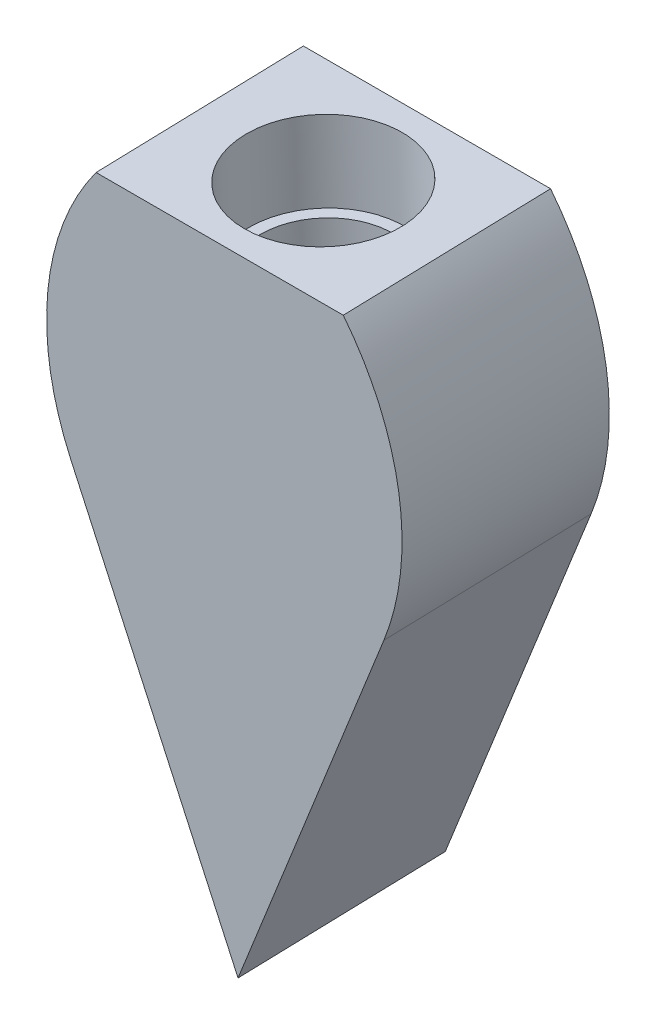
ISO-10303-21;
HEADER;
FILE_DESCRIPTION(('STEP AP214'),'2;1');
FILE_NAME('part.step','',(''),(''),'','','');
FILE_SCHEMA(('AUTOMOTIVE_DESIGN { 1 0 10303 214 1 1 1 1 }'));
ENDSEC;
DATA;
#1=APPLICATION_CONTEXT('core data for automotive mechanical design processes');
#2=APPLICATION_PROTOCOL_DEFINITION('international standard','automotive_design',2000,#1);
#3=PRODUCT_CONTEXT('',#1,'mechanical');
#4=PRODUCT('Part','Part','',(#3));
#5=PRODUCT_RELATED_PRODUCT_CATEGORY('part','',(#4));
#6=PRODUCT_DEFINITION_FORMATION('','',#4);
#7=PRODUCT_DEFINITION_CONTEXT('part definition',#1,'design');
#8=PRODUCT_DEFINITION('design','',#6,#7);
#9=PRODUCT_DEFINITION_SHAPE('','',#8);
#10=(LENGTH_UNIT() NAMED_UNIT(*) SI_UNIT(.MILLI.,.METRE.));
#11=(NAMED_UNIT(*) PLANE_ANGLE_UNIT() SI_UNIT($,.RADIAN.));
#12=(NAMED_UNIT(*) SI_UNIT($,.STERADIAN.) SOLID_ANGLE_UNIT());
#13=UNCERTAINTY_MEASURE_WITH_UNIT(LENGTH_MEASURE(1.E-05),#10,'distance_accuracy_value','');
#14=(GEOMETRIC_REPRESENTATION_CONTEXT(3) GLOBAL_UNCERTAINTY_ASSIGNED_CONTEXT((#13)) GLOBAL_UNIT_ASSIGNED_CONTEXT((#10,
#11,#12)) REPRESENTATION_CONTEXT('',''));
#15=CARTESIAN_POINT('',(0.,0.,0.));
#16=DIRECTION('',(0.,0.,1.));
#17=DIRECTION('',(1.,0.,0.));
#18=AXIS2_PLACEMENT_3D('',#15,#16,#17);
#19=CARTESIAN_POINT('',(0.414678604428741,3.08060174040735,3.85829431834856));
#20=DIRECTION('',(0.,-0.0284331085849651,0.999595697437817));
#21=DIRECTION('',(1.,0.,0.));
#22=AXIS2_PLACEMENT_3D('',#19,#20,#21);
#23=PLANE('',#22);
#24=DIRECTION('',(-0.384125658991873,-0.922907538189257,-0.0262517438945363));
#25=VECTOR('',#24,1.);
#26=CARTESIAN_POINT('',(11.1897790375301,-5.50877870607022,3.61397275160085));
#27=LINE('',#26,#25);
#28=CARTESIAN_POINT('',(6.11309491716632,-17.7061155254484,3.26702427721094));
#29=VERTEX_POINT('',#28);
#30=CARTESIAN_POINT('',(0.414678604428863,-31.3972378122761,2.8775856595486));
#31=VERTEX_POINT('',#30);
#32=EDGE_CURVE('E89',#29,#31,#27,.T.);
#33=ORIENTED_EDGE('',*,*,#32,.F.);
#34=CARTESIAN_POINT('',(-3.11971331274975,-13.8664119654109,3.37624314293481));
#35=DIRECTION('',(0.,-0.0284331085849651,0.999595697437817));
#36=DIRECTION('',(0.,-0.999595697437817,-0.0284331085849651));
#37=AXIS2_PLACEMENT_3D('',#34,#35,#36);
#38=CIRCLE('',#37,10.);
#39=CARTESIAN_POINT('',(4.91467860442871,-7.9149509314086,3.54553012391395));
#40=VERTEX_POINT('',#39);
#41=EDGE_CURVE('E50',#29,#40,#38,.T.);
#42=ORIENTED_EDGE('',*,*,#41,.T.);
#43=DIRECTION('',(-1.,0.,0.));
#44=VECTOR('',#43,1.);
#45=CARTESIAN_POINT('',(4.91467860442871,-7.9149509314086,3.54553012391395));
#46=LINE('',#45,#44);
#47=CARTESIAN_POINT('',(-4.08532139557131,-7.91495093140861,3.54553012391395));
#48=VERTEX_POINT('',#47);
#49=EDGE_CURVE('E95',#40,#48,#46,.T.);
#50=ORIENTED_EDGE('',*,*,#49,.T.);
#51=CARTESIAN_POINT('',(3.94907052160728,-13.8664119654108,3.37624314293482));
#52=DIRECTION('',(0.,-0.0284331085849651,0.999595697437817));
#53=DIRECTION('',(0.,-0.999595697437817,-0.0284331085849651));
#54=AXIS2_PLACEMENT_3D('',#51,#52,#53);
#55=CIRCLE('',#54,10.);
#56=CARTESIAN_POINT('',(-5.28373770830877,-17.7061155254483,3.26702427721094));
#57=VERTEX_POINT('',#56);
#58=EDGE_CURVE('E57',#48,#57,#55,.T.);
#59=ORIENTED_EDGE('',*,*,#58,.T.);
#60=DIRECTION('',(0.38412565899188,-0.922907538189254,-0.0262517438945362));
#61=VECTOR('',#60,1.);
#62=CARTESIAN_POINT('',(-10.3604218286727,-5.5087787060702,3.61397275160085));
#63=LINE('',#62,#61);
#64=EDGE_CURVE('E88',#57,#31,#63,.T.);
#65=ORIENTED_EDGE('',*,*,#64,.T.);
#66=EDGE_LOOP('',(#33,#42,#50,#59,#65));
#67=FACE_BOUND('',#66,.T.);
#68=ADVANCED_FACE('F41',(#67),#23,.T.);
#69=CARTESIAN_POINT('',(11.1897790375301,-6.54349663151712,39.990564612732));
#70=DIRECTION('',(0.923280822991607,-0.383970356003742,-0.0109218865723872));
#71=DIRECTION('',(0.38399325950517,0.923335895898451,0.));
#72=AXIS2_PLACEMENT_3D('',#69,#70,#71);
#73=PLANE('',#72);
#74=DIRECTION('',(0.384125658991873,0.922907538189257,0.0262517438945363));
#75=VECTOR('',#74,1.);
#76=CARTESIAN_POINT('',(11.1897790375301,-5.29410873625373,-3.93297476405468));
#77=LINE('',#76,#75);
#78=CARTESIAN_POINT('',(0.414678604428863,-31.1825678424596,-4.66936185610694));
#79=VERTEX_POINT('',#78);
#80=CARTESIAN_POINT('',(6.11309491716631,-17.4914455556319,-4.27992323844459));
#81=VERTEX_POINT('',#80);
#82=EDGE_CURVE('E132',#79,#81,#77,.T.);
#83=ORIENTED_EDGE('',*,*,#82,.T.);
#84=DIRECTION('',(0.,0.0284331085849651,-0.999595697437817));
#85=VECTOR('',#84,1.);
#86=CARTESIAN_POINT('',(6.11309491716631,-17.7061155254484,3.26702427721093));
#87=LINE('',#86,#85);
#88=EDGE_CURVE('E65',#81,#29,#87,.F.);
#89=ORIENTED_EDGE('',*,*,#88,.T.);
#90=ORIENTED_EDGE('',*,*,#32,.T.);
#91=DIRECTION('',(0.,-0.0284331085849651,0.999595697437817));
#92=VECTOR('',#91,1.);
#93=CARTESIAN_POINT('',(0.414678604428863,-30.8795622214262,-15.3218416642632));
#94=LINE('',#93,#92);
#95=EDGE_CURVE('E99',#79,#31,#94,.T.);
#96=ORIENTED_EDGE('',*,*,#95,.F.);
#97=EDGE_LOOP('',(#83,#89,#90,#96));
#98=FACE_BOUND('',#97,.T.);
#99=ADVANCED_FACE('F98',(#98),#73,.T.);
#100=CARTESIAN_POINT('',(-10.3604218286727,-6.54349663151709,39.990564612732));
#101=DIRECTION('',(0.923280822991604,0.38397035600375,0.0109218865723874));
#102=DIRECTION('',(-0.383993259505177,0.923335895898448,0.));
#103=AXIS2_PLACEMENT_3D('',#100,#101,#102);
#104=PLANE('',#103);
#105=ORIENTED_EDGE('',*,*,#64,.F.);
#106=DIRECTION('',(0.,-0.0284331085849651,0.999595697437817));
#107=VECTOR('',#106,1.);
#108=CARTESIAN_POINT('',(-5.28373770830876,-18.7408334508952,39.6436161383421));
#109=LINE('',#108,#107);
#110=CARTESIAN_POINT('',(-5.28373770830877,-17.4914455556318,-4.27992323844459));
#111=VERTEX_POINT('',#110);
#112=EDGE_CURVE('E11',#57,#111,#109,.F.);
#113=ORIENTED_EDGE('',*,*,#112,.T.);
#114=DIRECTION('',(-0.384125658991881,0.922907538189254,0.0262517438945362));
#115=VECTOR('',#114,1.);
#116=CARTESIAN_POINT('',(-10.3604218286727,-5.29410873625371,-3.93297476405467));
#117=LINE('',#116,#115);
#118=EDGE_CURVE('E105',#79,#111,#117,.T.);
#119=ORIENTED_EDGE('',*,*,#118,.F.);
#120=ORIENTED_EDGE('',*,*,#95,.T.);
#121=EDGE_LOOP('',(#105,#113,#119,#120));
#122=FACE_BOUND('',#121,.T.);
#123=ADVANCED_FACE('F103',(#122),#104,.F.);
#124=CARTESIAN_POINT('',(4.91467860442871,-8.94966885685549,39.9221219850451));
#125=DIRECTION('',(0.,-0.999595697437817,-0.0284331085849651));
#126=DIRECTION('',(0.,0.0284331085849651,-0.999595697437817));
#127=AXIS2_PLACEMENT_3D('',#124,#125,#126);
#128=PLANE('',#127);
#129=CARTESIAN_POINT('',(0.414678604428704,-7.80761594650036,-0.227943633913818));
#130=DIRECTION('',(0.,0.999595697437817,0.0284331085849651));
#131=DIRECTION('',(0.,-0.0284331085849651,0.999595697437817));
#132=AXIS2_PLACEMENT_3D('',#129,#130,#131);
#133=CIRCLE('',#132,2.87500000000001);
#134=CARTESIAN_POINT('',(0.414678604428704,-7.88936113368214,2.64589399621991));
#135=VERTEX_POINT('',#134);
#136=EDGE_CURVE('E112',#135,#135,#133,.T.);
#137=ORIENTED_EDGE('',*,*,#136,.F.);
#138=EDGE_LOOP('',(#137));
#139=FACE_BOUND('',#138,.T.);
#140=ORIENTED_EDGE('',*,*,#49,.F.);
#141=DIRECTION('',(0.,0.0284331085849651,-0.999595697437817));
#142=VECTOR('',#141,1.);
#143=CARTESIAN_POINT('',(4.91467860442871,-8.94966885685549,39.9221219850451));
#144=LINE('',#143,#142);
#145=CARTESIAN_POINT('',(4.91467860442871,-7.70028096159211,-4.00141739174158));
#146=VERTEX_POINT('',#145);
#147=EDGE_CURVE('E137',#40,#146,#144,.T.);
#148=ORIENTED_EDGE('',*,*,#147,.T.);
#149=DIRECTION('',(1.,0.,0.));
#150=VECTOR('',#149,1.);
#151=CARTESIAN_POINT('',(4.91467860442871,-7.70028096159211,-4.00141739174158));
#152=LINE('',#151,#150);
#153=CARTESIAN_POINT('',(-4.08532139557131,-7.70028096159211,-4.00141739174158));
#154=VERTEX_POINT('',#153);
#155=EDGE_CURVE('E126',#154,#146,#152,.T.);
#156=ORIENTED_EDGE('',*,*,#155,.F.);
#157=DIRECTION('',(0.,0.0284331085849651,-0.999595697437817));
#158=VECTOR('',#157,1.);
#159=CARTESIAN_POINT('',(-4.08532139557131,-8.9496688568555,39.9221219850451));
#160=LINE('',#159,#158);
#161=EDGE_CURVE('E101',#48,#154,#160,.T.);
#162=ORIENTED_EDGE('',*,*,#161,.F.);
#163=EDGE_LOOP('',(#140,#148,#156,#162));
#164=FACE_BOUND('',#163,.T.);
#165=ADVANCED_FACE('F159',(#139,#164),#128,.F.);
#166=CARTESIAN_POINT('',(-12.2568942708251,3.29527171022381,-3.68865319730697));
#167=DIRECTION('',(0.,-0.0284331085849651,0.999595697437817));
#168=DIRECTION('',(1.,0.,0.));
#169=AXIS2_PLACEMENT_3D('',#166,#167,#168);
#170=PLANE('',#169);
#171=ORIENTED_EDGE('',*,*,#155,.T.);
#172=CARTESIAN_POINT('',(-3.11971331274975,-13.6517419955945,-4.17070437272071));
#173=DIRECTION('',(0.,-0.0284331085849651,0.999595697437817));
#174=DIRECTION('',(0.,-0.999595697437817,-0.0284331085849651));
#175=AXIS2_PLACEMENT_3D('',#172,#173,#174);
#176=CIRCLE('',#175,10.);
#177=EDGE_CURVE('E147',#146,#81,#176,.F.);
#178=ORIENTED_EDGE('',*,*,#177,.T.);
#179=ORIENTED_EDGE('',*,*,#82,.F.);
#180=ORIENTED_EDGE('',*,*,#118,.T.);
#181=CARTESIAN_POINT('',(3.94907052160728,-13.6517419955943,-4.17070437272071));
#182=DIRECTION('',(0.,-0.0284331085849651,0.999595697437817));
#183=DIRECTION('',(0.,-0.999595697437817,-0.0284331085849651));
#184=AXIS2_PLACEMENT_3D('',#181,#182,#183);
#185=CIRCLE('',#184,10.);
#186=EDGE_CURVE('E141',#111,#154,#185,.F.);
#187=ORIENTED_EDGE('',*,*,#186,.T.);
#188=EDGE_LOOP('',(#171,#178,#179,#180,#187));
#189=FACE_BOUND('',#188,.T.);
#190=ADVANCED_FACE('F163',(#189),#170,.F.);
#191=CARTESIAN_POINT('',(0.414678604428704,-10.8064030388138,-0.313242959668713));
#192=DIRECTION('',(0.,0.999595697437817,0.0284331085849651));
#193=DIRECTION('',(0.,-0.0284331085849651,0.999595697437817));
#194=AXIS2_PLACEMENT_3D('',#191,#192,#193);
#195=CYLINDRICAL_SURFACE('',#194,2.87500000000001);
#196=CARTESIAN_POINT('',(0.414678604428704,-10.8064030388138,-0.313242959668713));
#197=DIRECTION('',(0.,0.999595697437817,0.0284331085849651));
#198=DIRECTION('',(0.,-0.0284331085849651,0.999595697437817));
#199=AXIS2_PLACEMENT_3D('',#196,#197,#198);
#200=CIRCLE('',#199,2.87500000000001);
#201=CARTESIAN_POINT('',(0.414678604428704,-10.8881482259956,2.56059467046502));
#202=VERTEX_POINT('',#201);
#203=EDGE_CURVE('E115',#202,#202,#200,.T.);
#204=ORIENTED_EDGE('',*,*,#203,.F.);
#205=EDGE_LOOP('',(#204));
#206=FACE_BOUND('',#205,.T.);
#207=ORIENTED_EDGE('',*,*,#136,.T.);
#208=EDGE_LOOP('',(#207));
#209=FACE_BOUND('',#208,.T.);
#210=ADVANCED_FACE('F184',(#206,#209),#195,.F.);
#211=CARTESIAN_POINT('',(0.414678604428704,-10.8064030388138,-0.313242959668713));
#212=DIRECTION('',(0.,0.999595697437817,0.0284331085849651));
#213=DIRECTION('',(0.,-0.0284331085849651,0.999595697437817));
#214=AXIS2_PLACEMENT_3D('',#211,#212,#213);
#215=PLANE('',#214);
#216=CARTESIAN_POINT('',(0.414678604428704,-10.8064030388138,-0.313242959668713));
#217=DIRECTION('',(0.,0.999595697437817,0.0284331085849651));
#218=DIRECTION('',(0.,-0.0284331085849651,0.999595697437817));
#219=AXIS2_PLACEMENT_3D('',#216,#217,#218);
#220=CIRCLE('',#219,2.45);
#221=CARTESIAN_POINT('',(0.414678604428704,-10.876064154847,2.13576649905394));
#222=VERTEX_POINT('',#221);
#223=EDGE_CURVE('E108',#222,#222,#220,.T.);
#224=ORIENTED_EDGE('',*,*,#223,.F.);
#225=EDGE_LOOP('',(#224));
#226=FACE_BOUND('',#225,.T.);
#227=ORIENTED_EDGE('',*,*,#203,.T.);
#228=EDGE_LOOP('',(#227));
#229=FACE_BOUND('',#228,.T.);
#230=ADVANCED_FACE('F191',(#226,#229),#215,.T.);
#231=CARTESIAN_POINT('',(0.,-17.8037394446027,-0.506420403913661));
#232=DIRECTION('',(0.,0.999595697437817,0.0284331085849651));
#233=DIRECTION('',(0.,-0.0284331085849651,0.999595697437817));
#234=AXIS2_PLACEMENT_3D('',#231,#232,#233);
#235=PLANE('',#234);
#236=CARTESIAN_POINT('',(0.414678604428706,-17.8035729208785,-0.512274719763469));
#237=DIRECTION('',(0.,0.999595697437817,0.0284331085849651));
#238=DIRECTION('',(0.,-0.0284331085849651,0.999595697437817));
#239=AXIS2_PLACEMENT_3D('',#236,#237,#238);
#240=CIRCLE('',#239,2.45);
#241=CARTESIAN_POINT('',(0.414678604428706,-17.8732340369117,1.93673473895918));
#242=VERTEX_POINT('',#241);
#243=EDGE_CURVE('E119',#242,#242,#240,.T.);
#244=ORIENTED_EDGE('',*,*,#243,.T.);
#245=EDGE_LOOP('',(#244));
#246=FACE_BOUND('',#245,.T.);
#247=ADVANCED_FACE('F187',(#246),#235,.T.);
#248=CARTESIAN_POINT('',(0.414678604428706,-17.8035729208785,-0.512274719763469));
#249=DIRECTION('',(0.,0.999595697437817,0.0284331085849651));
#250=DIRECTION('',(0.,-0.0284331085849651,0.999595697437817));
#251=AXIS2_PLACEMENT_3D('',#248,#249,#250);
#252=CYLINDRICAL_SURFACE('',#251,2.45);
#253=ORIENTED_EDGE('',*,*,#243,.F.);
#254=EDGE_LOOP('',(#253));
#255=FACE_BOUND('',#254,.T.);
#256=ORIENTED_EDGE('',*,*,#223,.T.);
#257=EDGE_LOOP('',(#256));
#258=FACE_BOUND('',#257,.T.);
#259=ADVANCED_FACE('F169',(#255,#258),#252,.F.);
#260=CARTESIAN_POINT('',(-3.11971331274975,-14.9011298908578,39.7528350040659));
#261=DIRECTION('',(0.,-0.0284331085849651,0.999595697437817));
#262=DIRECTION('',(0.,-0.999595697437817,-0.0284331085849651));
#263=AXIS2_PLACEMENT_3D('',#260,#261,#262);
#264=CYLINDRICAL_SURFACE('',#263,10.);
#265=ORIENTED_EDGE('',*,*,#41,.F.);
#266=ORIENTED_EDGE('',*,*,#88,.F.);
#267=ORIENTED_EDGE('',*,*,#177,.F.);
#268=ORIENTED_EDGE('',*,*,#147,.F.);
#269=EDGE_LOOP('',(#265,#266,#267,#268));
#270=FACE_BOUND('',#269,.T.);
#271=ADVANCED_FACE('F161',(#270),#264,.T.);
#272=CARTESIAN_POINT('',(3.94907052160728,-14.9011298908577,39.7528350040659));
#273=DIRECTION('',(0.,-0.0284331085849651,0.999595697437817));
#274=DIRECTION('',(0.,-0.999595697437817,-0.0284331085849651));
#275=AXIS2_PLACEMENT_3D('',#272,#273,#274);
#276=CYLINDRICAL_SURFACE('',#275,10.);
#277=ORIENTED_EDGE('',*,*,#58,.F.);
#278=ORIENTED_EDGE('',*,*,#161,.T.);
#279=ORIENTED_EDGE('',*,*,#186,.F.);
#280=ORIENTED_EDGE('',*,*,#112,.F.);
#281=EDGE_LOOP('',(#277,#278,#279,#280));
#282=FACE_BOUND('',#281,.T.);
#283=ADVANCED_FACE('F43',(#282),#276,.T.);
#284=CLOSED_SHELL('',(#68,#99,#123,#165,#190,#210,#230,#247,#259,#271,#283));
#285=MANIFOLD_SOLID_BREP('B2',#284);
#286=ADVANCED_BREP_SHAPE_REPRESENTATION('',(#18,#285),#14);
#287=SHAPE_DEFINITION_REPRESENTATION(#9,#286);
ENDSEC;
END-ISO-10303-21;
